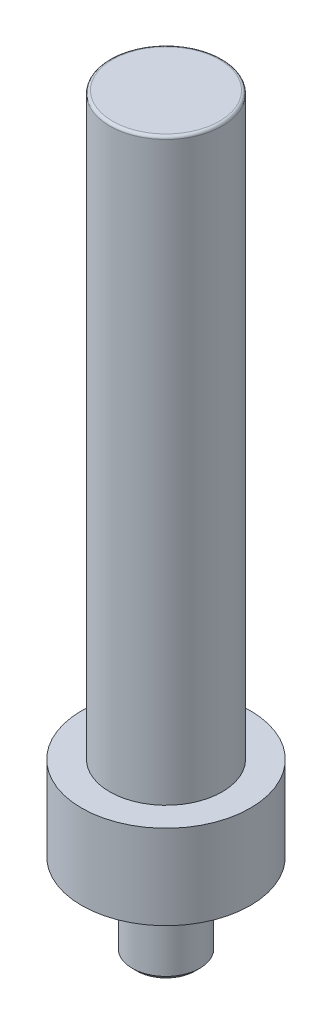
ISO-10303-21;
HEADER;
FILE_DESCRIPTION(('STEP AP214'),'2;1');
FILE_NAME('part.step','',(''),(''),'','','');
FILE_SCHEMA(('AUTOMOTIVE_DESIGN { 1 0 10303 214 1 1 1 1 }'));
ENDSEC;
DATA;
#1=APPLICATION_CONTEXT('core data for automotive mechanical design processes');
#2=APPLICATION_PROTOCOL_DEFINITION('international standard','automotive_design',2000,#1);
#3=PRODUCT_CONTEXT('',#1,'mechanical');
#4=PRODUCT('Part','Part','',(#3));
#5=PRODUCT_RELATED_PRODUCT_CATEGORY('part','',(#4));
#6=PRODUCT_DEFINITION_FORMATION('','',#4);
#7=PRODUCT_DEFINITION_CONTEXT('part definition',#1,'design');
#8=PRODUCT_DEFINITION('design','',#6,#7);
#9=PRODUCT_DEFINITION_SHAPE('','',#8);
#10=(LENGTH_UNIT() NAMED_UNIT(*) SI_UNIT(.MILLI.,.METRE.));
#11=(NAMED_UNIT(*) PLANE_ANGLE_UNIT() SI_UNIT($,.RADIAN.));
#12=(NAMED_UNIT(*) SI_UNIT($,.STERADIAN.) SOLID_ANGLE_UNIT());
#13=UNCERTAINTY_MEASURE_WITH_UNIT(LENGTH_MEASURE(1.E-05),#10,'distance_accuracy_value','');
#14=(GEOMETRIC_REPRESENTATION_CONTEXT(3) GLOBAL_UNCERTAINTY_ASSIGNED_CONTEXT((#13)) GLOBAL_UNIT_ASSIGNED_CONTEXT((#10,
#11,#12)) REPRESENTATION_CONTEXT('',''));
#15=CARTESIAN_POINT('',(0.,0.,0.));
#16=DIRECTION('',(0.,0.,1.));
#17=DIRECTION('',(1.,0.,0.));
#18=AXIS2_PLACEMENT_3D('',#15,#16,#17);
#19=CARTESIAN_POINT('',(0.,15.,0.));
#20=DIRECTION('',(0.,-1.,0.));
#21=DIRECTION('',(0.,0.,-1.));
#22=AXIS2_PLACEMENT_3D('',#19,#20,#21);
#23=CYLINDRICAL_SURFACE('',#22,15.);
#24=CARTESIAN_POINT('',(0.,15.,0.));
#25=DIRECTION('',(0.,1.,0.));
#26=DIRECTION('',(0.,0.,1.));
#27=AXIS2_PLACEMENT_3D('',#24,#25,#26);
#28=CIRCLE('',#27,15.);
#29=CARTESIAN_POINT('',(0.,15.,15.));
#30=VERTEX_POINT('',#29);
#31=EDGE_CURVE('E64',#30,#30,#28,.T.);
#32=ORIENTED_EDGE('',*,*,#31,.F.);
#33=EDGE_LOOP('',(#32));
#34=FACE_BOUND('',#33,.T.);
#35=CARTESIAN_POINT('',(0.,0.,0.));
#36=DIRECTION('',(0.,1.,0.));
#37=DIRECTION('',(0.,0.,1.));
#38=AXIS2_PLACEMENT_3D('',#35,#36,#37);
#39=CIRCLE('',#38,15.);
#40=CARTESIAN_POINT('',(0.,0.,15.));
#41=VERTEX_POINT('',#40);
#42=EDGE_CURVE('E67',#41,#41,#39,.T.);
#43=ORIENTED_EDGE('',*,*,#42,.T.);
#44=EDGE_LOOP('',(#43));
#45=FACE_BOUND('',#44,.T.);
#46=ADVANCED_FACE('F44',(#34,#45),#23,.T.);
#47=CARTESIAN_POINT('',(0.,15.,0.));
#48=DIRECTION('',(0.,1.,0.));
#49=DIRECTION('',(0.,0.,1.));
#50=AXIS2_PLACEMENT_3D('',#47,#48,#49);
#51=PLANE('',#50);
#52=CARTESIAN_POINT('',(0.,15.,0.));
#53=DIRECTION('',(0.,1.,0.));
#54=DIRECTION('',(0.,0.,1.));
#55=AXIS2_PLACEMENT_3D('',#52,#53,#54);
#56=CIRCLE('',#55,10.);
#57=CARTESIAN_POINT('',(0.,15.,10.));
#58=VERTEX_POINT('',#57);
#59=EDGE_CURVE('E58',#58,#58,#56,.T.);
#60=ORIENTED_EDGE('',*,*,#59,.F.);
#61=EDGE_LOOP('',(#60));
#62=FACE_BOUND('',#61,.T.);
#63=ORIENTED_EDGE('',*,*,#31,.T.);
#64=EDGE_LOOP('',(#63));
#65=FACE_BOUND('',#64,.T.);
#66=ADVANCED_FACE('F106',(#62,#65),#51,.T.);
#67=CARTESIAN_POINT('',(0.,0.,0.));
#68=DIRECTION('',(0.,1.,0.));
#69=DIRECTION('',(0.,0.,1.));
#70=AXIS2_PLACEMENT_3D('',#67,#68,#69);
#71=PLANE('',#70);
#72=ORIENTED_EDGE('',*,*,#42,.F.);
#73=EDGE_LOOP('',(#72));
#74=FACE_BOUND('',#73,.T.);
#75=CARTESIAN_POINT('',(0.,0.,0.));
#76=DIRECTION('',(0.,1.,0.));
#77=DIRECTION('',(0.,0.,1.));
#78=AXIS2_PLACEMENT_3D('',#75,#76,#77);
#79=CIRCLE('',#78,6.);
#80=CARTESIAN_POINT('',(0.,0.,6.));
#81=VERTEX_POINT('',#80);
#82=EDGE_CURVE('E71',#81,#81,#79,.T.);
#83=ORIENTED_EDGE('',*,*,#82,.T.);
#84=EDGE_LOOP('',(#83));
#85=FACE_BOUND('',#84,.T.);
#86=ADVANCED_FACE('F111',(#74,#85),#71,.F.);
#87=CARTESIAN_POINT('',(0.,118.,0.));
#88=DIRECTION('',(0.,-1.,0.));
#89=DIRECTION('',(0.,0.,-1.));
#90=AXIS2_PLACEMENT_3D('',#87,#88,#89);
#91=CYLINDRICAL_SURFACE('',#90,10.);
#92=CARTESIAN_POINT('',(0.,117.5,0.));
#93=DIRECTION('',(0.,1.,0.));
#94=DIRECTION('',(0.,0.,1.));
#95=AXIS2_PLACEMENT_3D('',#92,#93,#94);
#96=CIRCLE('',#95,10.);
#97=CARTESIAN_POINT('',(0.,117.5,10.));
#98=VERTEX_POINT('',#97);
#99=EDGE_CURVE('E10',#98,#98,#96,.F.);
#100=ORIENTED_EDGE('',*,*,#99,.T.);
#101=EDGE_LOOP('',(#100));
#102=FACE_BOUND('',#101,.T.);
#103=ORIENTED_EDGE('',*,*,#59,.T.);
#104=EDGE_LOOP('',(#103));
#105=FACE_BOUND('',#104,.T.);
#106=ADVANCED_FACE('F118',(#102,#105),#91,.T.);
#107=CARTESIAN_POINT('',(0.,118.,0.));
#108=DIRECTION('',(0.,1.,0.));
#109=DIRECTION('',(0.,0.,1.));
#110=AXIS2_PLACEMENT_3D('',#107,#108,#109);
#111=PLANE('',#110);
#112=CARTESIAN_POINT('',(0.,118.,0.));
#113=DIRECTION('',(0.,1.,0.));
#114=DIRECTION('',(0.,0.,1.));
#115=AXIS2_PLACEMENT_3D('',#112,#113,#114);
#116=CIRCLE('',#115,9.5);
#117=CARTESIAN_POINT('',(0.,118.,9.5));
#118=VERTEX_POINT('',#117);
#119=EDGE_CURVE('E52',#118,#118,#116,.T.);
#120=ORIENTED_EDGE('',*,*,#119,.T.);
#121=EDGE_LOOP('',(#120));
#122=FACE_BOUND('',#121,.T.);
#123=ADVANCED_FACE('F122',(#122),#111,.T.);
#124=CARTESIAN_POINT('',(0.,-15.,0.));
#125=DIRECTION('',(0.,1.,0.));
#126=DIRECTION('',(0.,0.,1.));
#127=AXIS2_PLACEMENT_3D('',#124,#125,#126);
#128=CYLINDRICAL_SURFACE('',#127,6.);
#129=ORIENTED_EDGE('',*,*,#82,.F.);
#130=EDGE_LOOP('',(#129));
#131=FACE_BOUND('',#130,.T.);
#132=CARTESIAN_POINT('',(0.,-14.172,0.));
#133=DIRECTION('',(0.,1.,0.));
#134=DIRECTION('',(0.,0.,1.));
#135=AXIS2_PLACEMENT_3D('',#132,#133,#134);
#136=CIRCLE('',#135,6.);
#137=CARTESIAN_POINT('',(0.,-14.172,6.));
#138=VERTEX_POINT('',#137);
#139=EDGE_CURVE('E82',#138,#138,#136,.T.);
#140=ORIENTED_EDGE('',*,*,#139,.T.);
#141=EDGE_LOOP('',(#140));
#142=FACE_BOUND('',#141,.T.);
#143=ADVANCED_FACE('F88',(#131,#142),#128,.T.);
#144=CARTESIAN_POINT('',(0.,-15.,0.));
#145=DIRECTION('',(0.,1.,0.));
#146=DIRECTION('',(0.,0.,1.));
#147=AXIS2_PLACEMENT_3D('',#144,#145,#146);
#148=CONICAL_SURFACE('',#147,5.172,0.785398163397449);
#149=ORIENTED_EDGE('',*,*,#139,.F.);
#150=EDGE_LOOP('',(#149));
#151=FACE_BOUND('',#150,.T.);
#152=CARTESIAN_POINT('',(0.,-15.,0.));
#153=DIRECTION('',(0.,1.,0.));
#154=DIRECTION('',(0.,0.,1.));
#155=AXIS2_PLACEMENT_3D('',#152,#153,#154);
#156=CIRCLE('',#155,5.172);
#157=CARTESIAN_POINT('',(0.,-15.,5.172));
#158=VERTEX_POINT('',#157);
#159=EDGE_CURVE('E78',#158,#158,#156,.T.);
#160=ORIENTED_EDGE('',*,*,#159,.T.);
#161=EDGE_LOOP('',(#160));
#162=FACE_BOUND('',#161,.T.);
#163=ADVANCED_FACE('F90',(#151,#162),#148,.T.);
#164=CARTESIAN_POINT('',(0.,-15.,0.));
#165=DIRECTION('',(0.,-1.,0.));
#166=DIRECTION('',(0.,0.,-1.));
#167=AXIS2_PLACEMENT_3D('',#164,#165,#166);
#168=PLANE('',#167);
#169=ORIENTED_EDGE('',*,*,#159,.F.);
#170=EDGE_LOOP('',(#169));
#171=FACE_BOUND('',#170,.T.);
#172=ADVANCED_FACE('F93',(#171),#168,.T.);
#173=CARTESIAN_POINT('',(0.,117.5,0.));
#174=DIRECTION('',(0.,1.,0.));
#175=DIRECTION('',(0.,0.,1.));
#176=AXIS2_PLACEMENT_3D('',#173,#174,#175);
#177=TOROIDAL_SURFACE('',#176,9.5,0.5);
#178=ORIENTED_EDGE('',*,*,#99,.F.);
#179=EDGE_LOOP('',(#178));
#180=FACE_BOUND('',#179,.T.);
#181=ORIENTED_EDGE('',*,*,#119,.F.);
#182=EDGE_LOOP('',(#181));
#183=FACE_BOUND('',#182,.T.);
#184=ADVANCED_FACE('F46',(#180,#183),#177,.T.);
#185=CLOSED_SHELL('',(#46,#66,#86,#106,#123,#143,#163,#172,#184));
#186=MANIFOLD_SOLID_BREP('B2',#185);
#187=ADVANCED_BREP_SHAPE_REPRESENTATION('',(#18,#186),#14);
#188=SHAPE_DEFINITION_REPRESENTATION(#9,#187);
ENDSEC;
END-ISO-10303-21;
